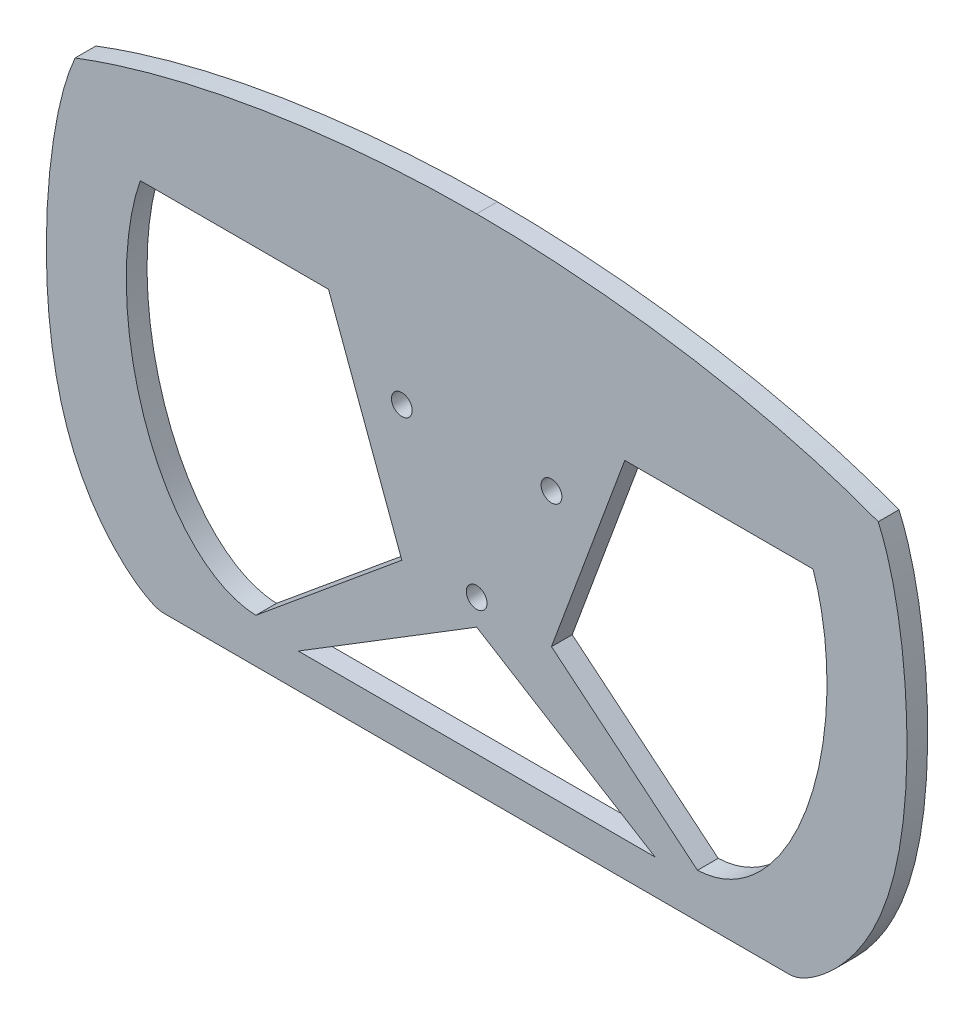
ISO-10303-21;
HEADER;
FILE_DESCRIPTION(('STEP AP214'),'2;1');
FILE_NAME('part.step','',(''),(''),'','','');
FILE_SCHEMA(('AUTOMOTIVE_DESIGN { 1 0 10303 214 1 1 1 1 }'));
ENDSEC;
DATA;
#1=APPLICATION_CONTEXT('core data for automotive mechanical design processes');
#2=APPLICATION_PROTOCOL_DEFINITION('international standard','automotive_design',2000,#1);
#3=PRODUCT_CONTEXT('',#1,'mechanical');
#4=PRODUCT('Part','Part','',(#3));
#5=PRODUCT_RELATED_PRODUCT_CATEGORY('part','',(#4));
#6=PRODUCT_DEFINITION_FORMATION('','',#4);
#7=PRODUCT_DEFINITION_CONTEXT('part definition',#1,'design');
#8=PRODUCT_DEFINITION('design','',#6,#7);
#9=PRODUCT_DEFINITION_SHAPE('','',#8);
#10=(LENGTH_UNIT() NAMED_UNIT(*) SI_UNIT(.MILLI.,.METRE.));
#11=(NAMED_UNIT(*) PLANE_ANGLE_UNIT() SI_UNIT($,.RADIAN.));
#12=(NAMED_UNIT(*) SI_UNIT($,.STERADIAN.) SOLID_ANGLE_UNIT());
#13=UNCERTAINTY_MEASURE_WITH_UNIT(LENGTH_MEASURE(1.E-05),#10,'distance_accuracy_value','');
#14=(GEOMETRIC_REPRESENTATION_CONTEXT(3) GLOBAL_UNCERTAINTY_ASSIGNED_CONTEXT((#13)) GLOBAL_UNIT_ASSIGNED_CONTEXT((#10,
#11,#12)) REPRESENTATION_CONTEXT('',''));
#15=CARTESIAN_POINT('',(0.,0.,0.));
#16=DIRECTION('',(0.,0.,1.));
#17=DIRECTION('',(1.,0.,0.));
#18=AXIS2_PLACEMENT_3D('',#15,#16,#17);
#19=CARTESIAN_POINT('',(-58.9785082805866,66.5630236830182,6.));
#20=DIRECTION('',(0.,0.,-1.));
#21=DIRECTION('',(-1.,0.,0.));
#22=AXIS2_PLACEMENT_3D('',#19,#20,#21);
#23=PLANE('',#22);
#24=DIRECTION('',(-0.85137562168258,0.524556527749489,0.));
#25=VECTOR('',#24,1.);
#26=CARTESIAN_POINT('',(51.5893844332926,-64.2369895868066,6.));
#27=LINE('',#26,#25);
#28=CARTESIAN_POINT('',(51.5893844332926,-64.2369895868066,6.));
#29=VERTEX_POINT('',#28);
#30=CARTESIAN_POINT('',(0.,-32.4513151114445,6.));
#31=VERTEX_POINT('',#30);
#32=EDGE_CURVE('E191',#29,#31,#27,.T.);
#33=ORIENTED_EDGE('',*,*,#32,.F.);
#34=DIRECTION('',(1.,0.,0.));
#35=VECTOR('',#34,1.);
#36=CARTESIAN_POINT('',(-51.5893844332926,-64.2369895868066,6.));
#37=LINE('',#36,#35);
#38=CARTESIAN_POINT('',(-51.5893844332926,-64.2369895868066,6.));
#39=VERTEX_POINT('',#38);
#40=EDGE_CURVE('E197',#39,#29,#37,.T.);
#41=ORIENTED_EDGE('',*,*,#40,.F.);
#42=DIRECTION('',(-0.85137562168258,-0.524556527749489,0.));
#43=VECTOR('',#42,1.);
#44=CARTESIAN_POINT('',(-51.5893844332926,-64.2369895868066,6.));
#45=LINE('',#44,#43);
#46=EDGE_CURVE('E193',#31,#39,#45,.T.);
#47=ORIENTED_EDGE('',*,*,#46,.F.);
#48=EDGE_LOOP('',(#33,#41,#47));
#49=FACE_BOUND('',#48,.T.);
#50=CARTESIAN_POINT('',(0.,-25.,6.));
#51=DIRECTION('',(0.,0.,1.));
#52=DIRECTION('',(1.,0.,0.));
#53=AXIS2_PLACEMENT_3D('',#50,#51,#52);
#54=CIRCLE('',#53,3.);
#55=CARTESIAN_POINT('',(3.,-25.,6.));
#56=VERTEX_POINT('',#55);
#57=EDGE_CURVE('E528',#56,#56,#54,.T.);
#58=ORIENTED_EDGE('',*,*,#57,.F.);
#59=EDGE_LOOP('',(#58));
#60=FACE_BOUND('',#59,.T.);
#61=CARTESIAN_POINT('',(21.650635094611,12.5,6.));
#62=DIRECTION('',(0.,0.,1.));
#63=DIRECTION('',(1.,0.,0.));
#64=AXIS2_PLACEMENT_3D('',#61,#62,#63);
#65=CIRCLE('',#64,3.00000000000001);
#66=CARTESIAN_POINT('',(24.650635094611,12.5,6.));
#67=VERTEX_POINT('',#66);
#68=EDGE_CURVE('E532',#67,#67,#65,.T.);
#69=ORIENTED_EDGE('',*,*,#68,.F.);
#70=EDGE_LOOP('',(#69));
#71=FACE_BOUND('',#70,.T.);
#72=CARTESIAN_POINT('',(-21.650635094611,12.5,6.));
#73=DIRECTION('',(0.,0.,1.));
#74=DIRECTION('',(1.,0.,0.));
#75=AXIS2_PLACEMENT_3D('',#72,#73,#74);
#76=CIRCLE('',#75,3.00000000000001);
#77=CARTESIAN_POINT('',(-18.650635094611,12.5,6.));
#78=VERTEX_POINT('',#77);
#79=EDGE_CURVE('E281',#78,#78,#76,.T.);
#80=ORIENTED_EDGE('',*,*,#79,.F.);
#81=EDGE_LOOP('',(#80));
#82=FACE_BOUND('',#81,.T.);
#83=CARTESIAN_POINT('',(0.,71.1085408069992,6.));
#84=CARTESIAN_POINT('',(-37.0664149320864,71.1085408069992,6.));
#85=CARTESIAN_POINT('',(-81.4792293024218,65.3354816362387,6.));
#86=CARTESIAN_POINT('',(-116.191133541168,52.063581327433,6.));
#87=B_SPLINE_CURVE_WITH_KNOTS('',3,(#83,#84,#85,#86),.UNSPECIFIED.,.F.,.F.,(4,4),(0.,1.),.UNSPECIFIED.);
#88=CARTESIAN_POINT('',(0.,71.1085408069992,6.));
#89=VERTEX_POINT('',#88);
#90=CARTESIAN_POINT('',(-116.191133541168,52.063581327433,6.));
#91=VERTEX_POINT('',#90);
#92=EDGE_CURVE('E304',#89,#91,#87,.T.);
#93=ORIENTED_EDGE('',*,*,#92,.T.);
#94=CARTESIAN_POINT('',(-116.191133541168,52.063581327433,6.));
#95=CARTESIAN_POINT('',(-129.535590873622,22.1396467031414,6.));
#96=CARTESIAN_POINT('',(-126.165778415932,-37.8430150437493,6.));
#97=CARTESIAN_POINT('',(-123.105866617516,-50.1204502558757,6.));
#98=CARTESIAN_POINT('',(-99.8338160125654,-74.2369895868065,6.));
#99=CARTESIAN_POINT('',(-90.5805588627204,-74.2369895868065,6.));
#100=B_SPLINE_CURVE_WITH_KNOTS('',5,(#94,#95,#96,#97,#98,#99),.UNSPECIFIED.,.F.,.F.,(6,6),(0.,
1.),.UNSPECIFIED.);
#101=CARTESIAN_POINT('',(-90.5805588627204,-74.2369895868065,6.));
#102=VERTEX_POINT('',#101);
#103=EDGE_CURVE('E339',#91,#102,#100,.T.);
#104=ORIENTED_EDGE('',*,*,#103,.T.);
#105=DIRECTION('',(1.,0.,0.));
#106=VECTOR('',#105,1.);
#107=CARTESIAN_POINT('',(-90.5805588627204,-74.2369895868065,6.));
#108=LINE('',#107,#106);
#109=CARTESIAN_POINT('',(90.5805588627204,-74.2369895868065,6.));
#110=VERTEX_POINT('',#109);
#111=EDGE_CURVE('E322',#102,#110,#108,.T.);
#112=ORIENTED_EDGE('',*,*,#111,.T.);
#113=CARTESIAN_POINT('',(90.5805588627204,-74.2369895868065,6.));
#114=CARTESIAN_POINT('',(99.8338160125654,-74.2369895868065,6.));
#115=CARTESIAN_POINT('',(123.105866617516,-50.1204502558757,6.));
#116=CARTESIAN_POINT('',(126.165778415932,-37.8430150437493,6.));
#117=CARTESIAN_POINT('',(129.535590873622,22.1396467031414,6.));
#118=CARTESIAN_POINT('',(116.191133541168,52.063581327433,6.));
#119=B_SPLINE_CURVE_WITH_KNOTS('',5,(#113,#114,#115,#116,#117,#118),.UNSPECIFIED.,.F.,.F.,(6,6),
(0.,1.),.UNSPECIFIED.);
#120=CARTESIAN_POINT('',(116.191133541168,52.063581327433,6.));
#121=VERTEX_POINT('',#120);
#122=EDGE_CURVE('E267',#110,#121,#119,.T.);
#123=ORIENTED_EDGE('',*,*,#122,.T.);
#124=CARTESIAN_POINT('',(116.191133541168,52.063581327433,6.));
#125=CARTESIAN_POINT('',(81.4792293024218,65.3354816362387,6.));
#126=CARTESIAN_POINT('',(37.0664149320864,71.1085408069992,6.));
#127=CARTESIAN_POINT('',(0.,71.1085408069992,6.));
#128=B_SPLINE_CURVE_WITH_KNOTS('',3,(#124,#125,#126,#127),.UNSPECIFIED.,.F.,.F.,(4,4),(0.,1.),.UNSPECIFIED.);
#129=EDGE_CURVE('E261',#121,#89,#128,.T.);
#130=ORIENTED_EDGE('',*,*,#129,.T.);
#131=EDGE_LOOP('',(#93,#104,#112,#123,#130));
#132=FACE_BOUND('',#131,.T.);
#133=CARTESIAN_POINT('',(63.8916441978117,-61.4317022475827,6.));
#134=CARTESIAN_POINT('',(88.8282563847214,-60.4881547594294,6.));
#135=CARTESIAN_POINT('',(106.351281164712,-21.9375002434502,6.));
#136=CARTESIAN_POINT('',(103.519165732587,13.1346791544171,6.));
#137=CARTESIAN_POINT('',(97.3201837781014,30.7663665948291,6.));
#138=B_SPLINE_CURVE_WITH_KNOTS('',4,(#133,#134,#135,#136,#137),.UNSPECIFIED.,.F.,.F.,(5,5),(0.,
1.),.UNSPECIFIED.);
#139=CARTESIAN_POINT('',(63.8916441978117,-61.4317022475827,6.));
#140=VERTEX_POINT('',#139);
#141=CARTESIAN_POINT('',(97.3201837781014,30.7663665948291,6.));
#142=VERTEX_POINT('',#141);
#143=EDGE_CURVE('E215',#140,#142,#138,.T.);
#144=ORIENTED_EDGE('',*,*,#143,.F.);
#145=DIRECTION('',(0.770813798016382,-0.637060506378758,0.));
#146=VECTOR('',#145,1.);
#147=CARTESIAN_POINT('',(21.650635094611,-26.5204451859092,6.));
#148=LINE('',#147,#146);
#149=CARTESIAN_POINT('',(21.650635094611,-26.5204451859092,6.));
#150=VERTEX_POINT('',#149);
#151=EDGE_CURVE('E557',#150,#140,#148,.T.);
#152=ORIENTED_EDGE('',*,*,#151,.F.);
#153=DIRECTION('',(-0.347257374644615,-0.937769862895439,0.));
#154=VECTOR('',#153,1.);
#155=CARTESIAN_POINT('',(42.864014461823,30.7663665948291,6.));
#156=LINE('',#155,#154);
#157=CARTESIAN_POINT('',(42.864014461823,30.7663665948291,6.));
#158=VERTEX_POINT('',#157);
#159=EDGE_CURVE('E573',#158,#150,#156,.T.);
#160=ORIENTED_EDGE('',*,*,#159,.F.);
#161=DIRECTION('',(-1.,0.,0.));
#162=VECTOR('',#161,1.);
#163=CARTESIAN_POINT('',(97.3201837781014,30.7663665948291,6.));
#164=LINE('',#163,#162);
#165=EDGE_CURVE('E220',#142,#158,#164,.T.);
#166=ORIENTED_EDGE('',*,*,#165,.F.);
#167=EDGE_LOOP('',(#144,#152,#160,#166));
#168=FACE_BOUND('',#167,.T.);
#169=CARTESIAN_POINT('',(-97.3201837781014,30.7663665948291,6.));
#170=CARTESIAN_POINT('',(-103.519165732587,13.1346791544171,6.));
#171=CARTESIAN_POINT('',(-106.351281164712,-21.9375002434502,6.));
#172=CARTESIAN_POINT('',(-88.8282563847214,-60.4881547594294,6.));
#173=CARTESIAN_POINT('',(-63.8916441978117,-61.4317022475827,6.));
#174=B_SPLINE_CURVE_WITH_KNOTS('',4,(#169,#170,#171,#172,#173),.UNSPECIFIED.,.F.,.F.,(5,5),(0.,
1.),.UNSPECIFIED.);
#175=CARTESIAN_POINT('',(-97.3201837781014,30.7663665948291,6.));
#176=VERTEX_POINT('',#175);
#177=CARTESIAN_POINT('',(-63.8916441978117,-61.4317022475827,6.));
#178=VERTEX_POINT('',#177);
#179=EDGE_CURVE('E147',#176,#178,#174,.T.);
#180=ORIENTED_EDGE('',*,*,#179,.F.);
#181=DIRECTION('',(-1.,0.,0.));
#182=VECTOR('',#181,1.);
#183=CARTESIAN_POINT('',(-97.3201837781014,30.7663665948291,6.));
#184=LINE('',#183,#182);
#185=CARTESIAN_POINT('',(-42.864014461823,30.7663665948291,6.));
#186=VERTEX_POINT('',#185);
#187=EDGE_CURVE('E169',#186,#176,#184,.T.);
#188=ORIENTED_EDGE('',*,*,#187,.F.);
#189=DIRECTION('',(-0.347257374644615,0.937769862895439,0.));
#190=VECTOR('',#189,1.);
#191=CARTESIAN_POINT('',(-42.864014461823,30.7663665948291,6.));
#192=LINE('',#191,#190);
#193=CARTESIAN_POINT('',(-21.650635094611,-26.5204451859092,6.));
#194=VERTEX_POINT('',#193);
#195=EDGE_CURVE('E167',#194,#186,#192,.T.);
#196=ORIENTED_EDGE('',*,*,#195,.F.);
#197=DIRECTION('',(0.770813798016382,0.637060506378758,0.));
#198=VECTOR('',#197,1.);
#199=CARTESIAN_POINT('',(-21.650635094611,-26.5204451859092,6.));
#200=LINE('',#199,#198);
#201=EDGE_CURVE('E155',#178,#194,#200,.T.);
#202=ORIENTED_EDGE('',*,*,#201,.F.);
#203=EDGE_LOOP('',(#180,#188,#196,#202));
#204=FACE_BOUND('',#203,.T.);
#205=ADVANCED_FACE('F33',(#49,#60,#71,#82,#132,#168,#204),#23,.F.);
#206=CARTESIAN_POINT('',(-58.9785082805866,66.5630236830182,0.));
#207=DIRECTION('',(0.,0.,-1.));
#208=DIRECTION('',(-1.,0.,0.));
#209=AXIS2_PLACEMENT_3D('',#206,#207,#208);
#210=PLANE('',#209);
#211=CARTESIAN_POINT('',(21.650635094611,12.5,0.));
#212=DIRECTION('',(0.,0.,1.));
#213=DIRECTION('',(1.,0.,0.));
#214=AXIS2_PLACEMENT_3D('',#211,#212,#213);
#215=CIRCLE('',#214,3.00000000000001);
#216=CARTESIAN_POINT('',(24.650635094611,12.5,0.));
#217=VERTEX_POINT('',#216);
#218=EDGE_CURVE('E539',#217,#217,#215,.T.);
#219=ORIENTED_EDGE('',*,*,#218,.T.);
#220=EDGE_LOOP('',(#219));
#221=FACE_BOUND('',#220,.T.);
#222=CARTESIAN_POINT('',(0.,71.1085408069992,0.));
#223=CARTESIAN_POINT('',(-37.0664149320864,71.1085408069992,0.));
#224=CARTESIAN_POINT('',(-81.4792293024218,65.3354816362387,0.));
#225=CARTESIAN_POINT('',(-116.191133541168,52.063581327433,0.));
#226=B_SPLINE_CURVE_WITH_KNOTS('',3,(#222,#223,#224,#225),.UNSPECIFIED.,.F.,.F.,(4,4),(0.,1.),.UNSPECIFIED.);
#227=CARTESIAN_POINT('',(0.,71.1085408069992,0.));
#228=VERTEX_POINT('',#227);
#229=CARTESIAN_POINT('',(-116.191133541168,52.063581327433,0.));
#230=VERTEX_POINT('',#229);
#231=EDGE_CURVE('E272',#228,#230,#226,.T.);
#232=ORIENTED_EDGE('',*,*,#231,.F.);
#233=CARTESIAN_POINT('',(116.191133541168,52.063581327433,0.));
#234=CARTESIAN_POINT('',(81.4792293024218,65.3354816362387,0.));
#235=CARTESIAN_POINT('',(37.0664149320864,71.1085408069992,0.));
#236=CARTESIAN_POINT('',(0.,71.1085408069992,0.));
#237=B_SPLINE_CURVE_WITH_KNOTS('',3,(#233,#234,#235,#236),.UNSPECIFIED.,.F.,.F.,(4,4),(0.,1.),.UNSPECIFIED.);
#238=CARTESIAN_POINT('',(116.191133541168,52.063581327433,0.));
#239=VERTEX_POINT('',#238);
#240=EDGE_CURVE('E297',#239,#228,#237,.T.);
#241=ORIENTED_EDGE('',*,*,#240,.F.);
#242=CARTESIAN_POINT('',(90.5805588627204,-74.2369895868065,0.));
#243=CARTESIAN_POINT('',(99.8338160125654,-74.2369895868065,0.));
#244=CARTESIAN_POINT('',(123.105866617516,-50.1204502558757,0.));
#245=CARTESIAN_POINT('',(126.165778415932,-37.8430150437493,0.));
#246=CARTESIAN_POINT('',(129.535590873622,22.1396467031414,0.));
#247=CARTESIAN_POINT('',(116.191133541168,52.063581327433,0.));
#248=B_SPLINE_CURVE_WITH_KNOTS('',5,(#242,#243,#244,#245,#246,#247),.UNSPECIFIED.,.F.,.F.,(6,6),
(0.,1.),.UNSPECIFIED.);
#249=CARTESIAN_POINT('',(90.5805588627204,-74.2369895868065,0.));
#250=VERTEX_POINT('',#249);
#251=EDGE_CURVE('E293',#250,#239,#248,.T.);
#252=ORIENTED_EDGE('',*,*,#251,.F.);
#253=DIRECTION('',(1.,0.,0.));
#254=VECTOR('',#253,1.);
#255=CARTESIAN_POINT('',(-90.5805588627204,-74.2369895868065,0.));
#256=LINE('',#255,#254);
#257=CARTESIAN_POINT('',(-90.5805588627204,-74.2369895868065,0.));
#258=VERTEX_POINT('',#257);
#259=EDGE_CURVE('E288',#258,#250,#256,.T.);
#260=ORIENTED_EDGE('',*,*,#259,.F.);
#261=CARTESIAN_POINT('',(-116.191133541168,52.063581327433,0.));
#262=CARTESIAN_POINT('',(-129.535590873622,22.1396467031414,0.));
#263=CARTESIAN_POINT('',(-126.165778415932,-37.8430150437493,0.));
#264=CARTESIAN_POINT('',(-123.105866617516,-50.1204502558757,0.));
#265=CARTESIAN_POINT('',(-99.8338160125654,-74.2369895868065,0.));
#266=CARTESIAN_POINT('',(-90.5805588627204,-74.2369895868065,0.));
#267=B_SPLINE_CURVE_WITH_KNOTS('',5,(#261,#262,#263,#264,#265,#266),.UNSPECIFIED.,.F.,.F.,(6,6),
(0.,1.),.UNSPECIFIED.);
#268=EDGE_CURVE('E280',#230,#258,#267,.T.);
#269=ORIENTED_EDGE('',*,*,#268,.F.);
#270=EDGE_LOOP('',(#232,#241,#252,#260,#269));
#271=FACE_BOUND('',#270,.T.);
#272=CARTESIAN_POINT('',(-21.650635094611,12.5,0.));
#273=DIRECTION('',(0.,0.,1.));
#274=DIRECTION('',(1.,0.,0.));
#275=AXIS2_PLACEMENT_3D('',#272,#273,#274);
#276=CIRCLE('',#275,3.00000000000001);
#277=CARTESIAN_POINT('',(-18.650635094611,12.5,0.));
#278=VERTEX_POINT('',#277);
#279=EDGE_CURVE('E535',#278,#278,#276,.T.);
#280=ORIENTED_EDGE('',*,*,#279,.T.);
#281=EDGE_LOOP('',(#280));
#282=FACE_BOUND('',#281,.T.);
#283=CARTESIAN_POINT('',(0.,-25.,0.));
#284=DIRECTION('',(0.,0.,1.));
#285=DIRECTION('',(1.,0.,0.));
#286=AXIS2_PLACEMENT_3D('',#283,#284,#285);
#287=CIRCLE('',#286,3.);
#288=CARTESIAN_POINT('',(3.,-25.,0.));
#289=VERTEX_POINT('',#288);
#290=EDGE_CURVE('E543',#289,#289,#287,.T.);
#291=ORIENTED_EDGE('',*,*,#290,.T.);
#292=EDGE_LOOP('',(#291));
#293=FACE_BOUND('',#292,.T.);
#294=DIRECTION('',(0.770813798016382,-0.637060506378758,0.));
#295=VECTOR('',#294,1.);
#296=CARTESIAN_POINT('',(21.650635094611,-26.5204451859092,0.));
#297=LINE('',#296,#295);
#298=CARTESIAN_POINT('',(21.650635094611,-26.5204451859092,0.));
#299=VERTEX_POINT('',#298);
#300=CARTESIAN_POINT('',(63.8916441978117,-61.4317022475827,0.));
#301=VERTEX_POINT('',#300);
#302=EDGE_CURVE('E221',#299,#301,#297,.T.);
#303=ORIENTED_EDGE('',*,*,#302,.T.);
#304=CARTESIAN_POINT('',(63.8916441978117,-61.4317022475827,0.));
#305=CARTESIAN_POINT('',(88.8282563847214,-60.4881547594294,0.));
#306=CARTESIAN_POINT('',(106.351281164712,-21.9375002434502,0.));
#307=CARTESIAN_POINT('',(103.519165732587,13.1346791544171,0.));
#308=CARTESIAN_POINT('',(97.3201837781014,30.7663665948291,0.));
#309=B_SPLINE_CURVE_WITH_KNOTS('',4,(#304,#305,#306,#307,#308),.UNSPECIFIED.,.F.,.F.,(5,5),(0.,
1.),.UNSPECIFIED.);
#310=CARTESIAN_POINT('',(97.3201837781014,30.7663665948291,0.));
#311=VERTEX_POINT('',#310);
#312=EDGE_CURVE('E214',#301,#311,#309,.T.);
#313=ORIENTED_EDGE('',*,*,#312,.T.);
#314=DIRECTION('',(-1.,0.,0.));
#315=VECTOR('',#314,1.);
#316=CARTESIAN_POINT('',(97.3201837781014,30.7663665948291,0.));
#317=LINE('',#316,#315);
#318=CARTESIAN_POINT('',(42.864014461823,30.7663665948291,0.));
#319=VERTEX_POINT('',#318);
#320=EDGE_CURVE('E563',#311,#319,#317,.T.);
#321=ORIENTED_EDGE('',*,*,#320,.T.);
#322=DIRECTION('',(-0.347257374644615,-0.937769862895439,0.));
#323=VECTOR('',#322,1.);
#324=CARTESIAN_POINT('',(42.864014461823,30.7663665948291,0.));
#325=LINE('',#324,#323);
#326=EDGE_CURVE('E560',#319,#299,#325,.T.);
#327=ORIENTED_EDGE('',*,*,#326,.T.);
#328=EDGE_LOOP('',(#303,#313,#321,#327));
#329=FACE_BOUND('',#328,.T.);
#330=DIRECTION('',(1.,0.,0.));
#331=VECTOR('',#330,1.);
#332=CARTESIAN_POINT('',(-51.5893844332926,-64.2369895868066,0.));
#333=LINE('',#332,#331);
#334=CARTESIAN_POINT('',(-51.5893844332926,-64.2369895868066,0.));
#335=VERTEX_POINT('',#334);
#336=CARTESIAN_POINT('',(51.5893844332926,-64.2369895868066,0.));
#337=VERTEX_POINT('',#336);
#338=EDGE_CURVE('E194',#335,#337,#333,.T.);
#339=ORIENTED_EDGE('',*,*,#338,.T.);
#340=DIRECTION('',(-0.85137562168258,0.524556527749489,0.));
#341=VECTOR('',#340,1.);
#342=CARTESIAN_POINT('',(51.5893844332926,-64.2369895868066,0.));
#343=LINE('',#342,#341);
#344=CARTESIAN_POINT('',(0.,-32.4513151114445,0.));
#345=VERTEX_POINT('',#344);
#346=EDGE_CURVE('E163',#337,#345,#343,.T.);
#347=ORIENTED_EDGE('',*,*,#346,.T.);
#348=DIRECTION('',(-0.85137562168258,-0.524556527749489,0.));
#349=VECTOR('',#348,1.);
#350=CARTESIAN_POINT('',(-51.5893844332926,-64.2369895868066,0.));
#351=LINE('',#350,#349);
#352=EDGE_CURVE('E202',#345,#335,#351,.T.);
#353=ORIENTED_EDGE('',*,*,#352,.T.);
#354=EDGE_LOOP('',(#339,#347,#353));
#355=FACE_BOUND('',#354,.T.);
#356=DIRECTION('',(-1.,0.,0.));
#357=VECTOR('',#356,1.);
#358=CARTESIAN_POINT('',(-97.3201837781014,30.7663665948291,0.));
#359=LINE('',#358,#357);
#360=CARTESIAN_POINT('',(-42.864014461823,30.7663665948291,0.));
#361=VERTEX_POINT('',#360);
#362=CARTESIAN_POINT('',(-97.3201837781014,30.7663665948291,0.));
#363=VERTEX_POINT('',#362);
#364=EDGE_CURVE('E156',#361,#363,#359,.T.);
#365=ORIENTED_EDGE('',*,*,#364,.T.);
#366=CARTESIAN_POINT('',(-97.3201837781014,30.7663665948291,0.));
#367=CARTESIAN_POINT('',(-103.519165732587,13.1346791544171,0.));
#368=CARTESIAN_POINT('',(-106.351281164712,-21.9375002434502,0.));
#369=CARTESIAN_POINT('',(-88.8282563847214,-60.4881547594294,0.));
#370=CARTESIAN_POINT('',(-63.8916441978117,-61.4317022475827,0.));
#371=B_SPLINE_CURVE_WITH_KNOTS('',4,(#366,#367,#368,#369,#370),.UNSPECIFIED.,.F.,.F.,(5,5),(0.,
1.),.UNSPECIFIED.);
#372=CARTESIAN_POINT('',(-63.8916441978117,-61.4317022475827,0.));
#373=VERTEX_POINT('',#372);
#374=EDGE_CURVE('E57',#363,#373,#371,.T.);
#375=ORIENTED_EDGE('',*,*,#374,.T.);
#376=DIRECTION('',(0.770813798016382,0.637060506378758,0.));
#377=VECTOR('',#376,1.);
#378=CARTESIAN_POINT('',(-21.650635094611,-26.5204451859092,0.));
#379=LINE('',#378,#377);
#380=CARTESIAN_POINT('',(-21.650635094611,-26.5204451859092,0.));
#381=VERTEX_POINT('',#380);
#382=EDGE_CURVE('E162',#373,#381,#379,.T.);
#383=ORIENTED_EDGE('',*,*,#382,.T.);
#384=DIRECTION('',(-0.347257374644615,0.937769862895439,0.));
#385=VECTOR('',#384,1.);
#386=CARTESIAN_POINT('',(-42.864014461823,30.7663665948291,0.));
#387=LINE('',#386,#385);
#388=EDGE_CURVE('E183',#381,#361,#387,.T.);
#389=ORIENTED_EDGE('',*,*,#388,.T.);
#390=EDGE_LOOP('',(#365,#375,#383,#389));
#391=FACE_BOUND('',#390,.T.);
#392=ADVANCED_FACE('F249',(#221,#271,#282,#293,#329,#355,#391),#210,.T.);
#393=DIRECTION('',(0.,0.,-1.));
#394=VECTOR('',#393,1.);
#395=SURFACE_OF_LINEAR_EXTRUSION('',#87,#394);
#396=ORIENTED_EDGE('',*,*,#231,.T.);
#397=DIRECTION('',(0.,0.,-1.));
#398=VECTOR('',#397,1.);
#399=CARTESIAN_POINT('',(-116.191133541168,52.063581327433,6.));
#400=LINE('',#399,#398);
#401=EDGE_CURVE('E11',#91,#230,#400,.T.);
#402=ORIENTED_EDGE('',*,*,#401,.F.);
#403=ORIENTED_EDGE('',*,*,#92,.F.);
#404=DIRECTION('',(0.,0.,-1.));
#405=VECTOR('',#404,1.);
#406=CARTESIAN_POINT('',(0.,71.1085408069992,6.));
#407=LINE('',#406,#405);
#408=EDGE_CURVE('E266',#89,#228,#407,.T.);
#409=ORIENTED_EDGE('',*,*,#408,.T.);
#410=EDGE_LOOP('',(#396,#402,#403,#409));
#411=FACE_BOUND('',#410,.T.);
#412=ADVANCED_FACE('F35',(#411),#395,.F.);
#413=DIRECTION('',(0.,0.,-1.));
#414=VECTOR('',#413,1.);
#415=SURFACE_OF_LINEAR_EXTRUSION('',#100,#414);
#416=ORIENTED_EDGE('',*,*,#268,.T.);
#417=DIRECTION('',(0.,0.,-1.));
#418=VECTOR('',#417,1.);
#419=CARTESIAN_POINT('',(-90.5805588627204,-74.2369895868065,6.));
#420=LINE('',#419,#418);
#421=EDGE_CURVE('E42',#102,#258,#420,.T.);
#422=ORIENTED_EDGE('',*,*,#421,.F.);
#423=ORIENTED_EDGE('',*,*,#103,.F.);
#424=ORIENTED_EDGE('',*,*,#401,.T.);
#425=EDGE_LOOP('',(#416,#422,#423,#424));
#426=FACE_BOUND('',#425,.T.);
#427=ADVANCED_FACE('F351',(#426),#415,.F.);
#428=CARTESIAN_POINT('',(-90.5805588627204,-74.2369895868065,6.));
#429=DIRECTION('',(0.,1.,0.));
#430=DIRECTION('',(0.,0.,1.));
#431=AXIS2_PLACEMENT_3D('',#428,#429,#430);
#432=PLANE('',#431);
#433=ORIENTED_EDGE('',*,*,#259,.T.);
#434=DIRECTION('',(0.,0.,-1.));
#435=VECTOR('',#434,1.);
#436=CARTESIAN_POINT('',(90.5805588627204,-74.2369895868065,6.));
#437=LINE('',#436,#435);
#438=EDGE_CURVE('E313',#110,#250,#437,.T.);
#439=ORIENTED_EDGE('',*,*,#438,.F.);
#440=ORIENTED_EDGE('',*,*,#111,.F.);
#441=ORIENTED_EDGE('',*,*,#421,.T.);
#442=EDGE_LOOP('',(#433,#439,#440,#441));
#443=FACE_BOUND('',#442,.T.);
#444=ADVANCED_FACE('F320',(#443),#432,.F.);
#445=DIRECTION('',(0.,0.,-1.));
#446=VECTOR('',#445,1.);
#447=SURFACE_OF_LINEAR_EXTRUSION('',#119,#446);
#448=ORIENTED_EDGE('',*,*,#251,.T.);
#449=DIRECTION('',(0.,0.,-1.));
#450=VECTOR('',#449,1.);
#451=CARTESIAN_POINT('',(116.191133541168,52.063581327433,6.));
#452=LINE('',#451,#450);
#453=EDGE_CURVE('E310',#121,#239,#452,.T.);
#454=ORIENTED_EDGE('',*,*,#453,.F.);
#455=ORIENTED_EDGE('',*,*,#122,.F.);
#456=ORIENTED_EDGE('',*,*,#438,.T.);
#457=EDGE_LOOP('',(#448,#454,#455,#456));
#458=FACE_BOUND('',#457,.T.);
#459=ADVANCED_FACE('F257',(#458),#447,.F.);
#460=DIRECTION('',(0.,0.,-1.));
#461=VECTOR('',#460,1.);
#462=SURFACE_OF_LINEAR_EXTRUSION('',#128,#461);
#463=ORIENTED_EDGE('',*,*,#240,.T.);
#464=ORIENTED_EDGE('',*,*,#408,.F.);
#465=ORIENTED_EDGE('',*,*,#129,.F.);
#466=ORIENTED_EDGE('',*,*,#453,.T.);
#467=EDGE_LOOP('',(#463,#464,#465,#466));
#468=FACE_BOUND('',#467,.T.);
#469=ADVANCED_FACE('F245',(#468),#462,.F.);
#470=CARTESIAN_POINT('',(-21.650635094611,12.5,6.));
#471=DIRECTION('',(0.,0.,-1.));
#472=DIRECTION('',(-1.,0.,0.));
#473=AXIS2_PLACEMENT_3D('',#470,#471,#472);
#474=CYLINDRICAL_SURFACE('',#473,3.00000000000001);
#475=ORIENTED_EDGE('',*,*,#79,.T.);
#476=EDGE_LOOP('',(#475));
#477=FACE_BOUND('',#476,.T.);
#478=ORIENTED_EDGE('',*,*,#279,.F.);
#479=EDGE_LOOP('',(#478));
#480=FACE_BOUND('',#479,.T.);
#481=ADVANCED_FACE('F241',(#477,#480),#474,.F.);
#482=CARTESIAN_POINT('',(21.650635094611,12.5,6.));
#483=DIRECTION('',(0.,0.,-1.));
#484=DIRECTION('',(-1.,0.,0.));
#485=AXIS2_PLACEMENT_3D('',#482,#483,#484);
#486=CYLINDRICAL_SURFACE('',#485,3.00000000000001);
#487=ORIENTED_EDGE('',*,*,#68,.T.);
#488=EDGE_LOOP('',(#487));
#489=FACE_BOUND('',#488,.T.);
#490=ORIENTED_EDGE('',*,*,#218,.F.);
#491=EDGE_LOOP('',(#490));
#492=FACE_BOUND('',#491,.T.);
#493=ADVANCED_FACE('F237',(#489,#492),#486,.F.);
#494=CARTESIAN_POINT('',(0.,-25.,6.));
#495=DIRECTION('',(0.,0.,-1.));
#496=DIRECTION('',(-1.,0.,0.));
#497=AXIS2_PLACEMENT_3D('',#494,#495,#496);
#498=CYLINDRICAL_SURFACE('',#497,3.);
#499=ORIENTED_EDGE('',*,*,#57,.T.);
#500=EDGE_LOOP('',(#499));
#501=FACE_BOUND('',#500,.T.);
#502=ORIENTED_EDGE('',*,*,#290,.F.);
#503=EDGE_LOOP('',(#502));
#504=FACE_BOUND('',#503,.T.);
#505=ADVANCED_FACE('F232',(#501,#504),#498,.F.);
#506=DIRECTION('',(0.,0.,-1.));
#507=VECTOR('',#506,1.);
#508=SURFACE_OF_LINEAR_EXTRUSION('',#138,#507);
#509=ORIENTED_EDGE('',*,*,#312,.F.);
#510=DIRECTION('',(0.,0.,-1.));
#511=VECTOR('',#510,1.);
#512=CARTESIAN_POINT('',(63.8916441978117,-61.4317022475827,6.));
#513=LINE('',#512,#511);
#514=EDGE_CURVE('E554',#140,#301,#513,.T.);
#515=ORIENTED_EDGE('',*,*,#514,.F.);
#516=ORIENTED_EDGE('',*,*,#143,.T.);
#517=DIRECTION('',(0.,0.,-1.));
#518=VECTOR('',#517,1.);
#519=CARTESIAN_POINT('',(97.3201837781014,30.7663665948291,6.));
#520=LINE('',#519,#518);
#521=EDGE_CURVE('E546',#142,#311,#520,.T.);
#522=ORIENTED_EDGE('',*,*,#521,.T.);
#523=EDGE_LOOP('',(#509,#515,#516,#522));
#524=FACE_BOUND('',#523,.T.);
#525=ADVANCED_FACE('F227',(#524),#508,.T.);
#526=CARTESIAN_POINT('',(97.3201837781014,30.7663665948291,6.));
#527=DIRECTION('',(0.,-1.,0.));
#528=DIRECTION('',(0.,0.,-1.));
#529=AXIS2_PLACEMENT_3D('',#526,#527,#528);
#530=PLANE('',#529);
#531=ORIENTED_EDGE('',*,*,#320,.F.);
#532=ORIENTED_EDGE('',*,*,#521,.F.);
#533=ORIENTED_EDGE('',*,*,#165,.T.);
#534=DIRECTION('',(0.,0.,-1.));
#535=VECTOR('',#534,1.);
#536=CARTESIAN_POINT('',(42.864014461823,30.7663665948291,6.));
#537=LINE('',#536,#535);
#538=EDGE_CURVE('E550',#158,#319,#537,.T.);
#539=ORIENTED_EDGE('',*,*,#538,.T.);
#540=EDGE_LOOP('',(#531,#532,#533,#539));
#541=FACE_BOUND('',#540,.T.);
#542=ADVANCED_FACE('F231',(#541),#530,.T.);
#543=CARTESIAN_POINT('',(42.864014461823,30.7663665948291,6.));
#544=DIRECTION('',(0.937769862895439,-0.347257374644615,0.));
#545=DIRECTION('',(0.347257374644615,0.937769862895439,0.));
#546=AXIS2_PLACEMENT_3D('',#543,#544,#545);
#547=PLANE('',#546);
#548=ORIENTED_EDGE('',*,*,#326,.F.);
#549=ORIENTED_EDGE('',*,*,#538,.F.);
#550=ORIENTED_EDGE('',*,*,#159,.T.);
#551=DIRECTION('',(0.,0.,-1.));
#552=VECTOR('',#551,1.);
#553=CARTESIAN_POINT('',(21.650635094611,-26.5204451859092,6.));
#554=LINE('',#553,#552);
#555=EDGE_CURVE('E552',#150,#299,#554,.T.);
#556=ORIENTED_EDGE('',*,*,#555,.T.);
#557=EDGE_LOOP('',(#548,#549,#550,#556));
#558=FACE_BOUND('',#557,.T.);
#559=ADVANCED_FACE('F385',(#558),#547,.T.);
#560=CARTESIAN_POINT('',(21.650635094611,-26.5204451859092,6.));
#561=DIRECTION('',(0.637060506378758,0.770813798016383,0.));
#562=DIRECTION('',(-0.770813798016383,0.637060506378758,0.));
#563=AXIS2_PLACEMENT_3D('',#560,#561,#562);
#564=PLANE('',#563);
#565=ORIENTED_EDGE('',*,*,#302,.F.);
#566=ORIENTED_EDGE('',*,*,#555,.F.);
#567=ORIENTED_EDGE('',*,*,#151,.T.);
#568=ORIENTED_EDGE('',*,*,#514,.T.);
#569=EDGE_LOOP('',(#565,#566,#567,#568));
#570=FACE_BOUND('',#569,.T.);
#571=ADVANCED_FACE('F392',(#570),#564,.T.);
#572=CARTESIAN_POINT('',(51.5893844332926,-64.2369895868066,6.));
#573=DIRECTION('',(-0.524556527749489,-0.85137562168258,0.));
#574=DIRECTION('',(0.85137562168258,-0.524556527749489,0.));
#575=AXIS2_PLACEMENT_3D('',#572,#573,#574);
#576=PLANE('',#575);
#577=ORIENTED_EDGE('',*,*,#346,.F.);
#578=DIRECTION('',(0.,0.,-1.));
#579=VECTOR('',#578,1.);
#580=CARTESIAN_POINT('',(51.5893844332926,-64.2369895868066,6.));
#581=LINE('',#580,#579);
#582=EDGE_CURVE('E199',#29,#337,#581,.T.);
#583=ORIENTED_EDGE('',*,*,#582,.F.);
#584=ORIENTED_EDGE('',*,*,#32,.T.);
#585=DIRECTION('',(0.,0.,-1.));
#586=VECTOR('',#585,1.);
#587=CARTESIAN_POINT('',(0.,-32.4513151114445,6.));
#588=LINE('',#587,#586);
#589=EDGE_CURVE('E211',#31,#345,#588,.T.);
#590=ORIENTED_EDGE('',*,*,#589,.T.);
#591=EDGE_LOOP('',(#577,#583,#584,#590));
#592=FACE_BOUND('',#591,.T.);
#593=ADVANCED_FACE('F399',(#592),#576,.T.);
#594=CARTESIAN_POINT('',(-51.5893844332926,-64.2369895868066,6.));
#595=DIRECTION('',(0.524556527749489,-0.85137562168258,0.));
#596=DIRECTION('',(0.85137562168258,0.524556527749489,0.));
#597=AXIS2_PLACEMENT_3D('',#594,#595,#596);
#598=PLANE('',#597);
#599=ORIENTED_EDGE('',*,*,#352,.F.);
#600=ORIENTED_EDGE('',*,*,#589,.F.);
#601=ORIENTED_EDGE('',*,*,#46,.T.);
#602=DIRECTION('',(0.,0.,-1.));
#603=VECTOR('',#602,1.);
#604=CARTESIAN_POINT('',(-51.5893844332926,-64.2369895868066,6.));
#605=LINE('',#604,#603);
#606=EDGE_CURVE('E209',#39,#335,#605,.T.);
#607=ORIENTED_EDGE('',*,*,#606,.T.);
#608=EDGE_LOOP('',(#599,#600,#601,#607));
#609=FACE_BOUND('',#608,.T.);
#610=ADVANCED_FACE('F407',(#609),#598,.T.);
#611=CARTESIAN_POINT('',(-51.5893844332926,-64.2369895868066,6.));
#612=DIRECTION('',(0.,1.,0.));
#613=DIRECTION('',(0.,0.,1.));
#614=AXIS2_PLACEMENT_3D('',#611,#612,#613);
#615=PLANE('',#614);
#616=ORIENTED_EDGE('',*,*,#338,.F.);
#617=ORIENTED_EDGE('',*,*,#606,.F.);
#618=ORIENTED_EDGE('',*,*,#40,.T.);
#619=ORIENTED_EDGE('',*,*,#582,.T.);
#620=EDGE_LOOP('',(#616,#617,#618,#619));
#621=FACE_BOUND('',#620,.T.);
#622=ADVANCED_FACE('F415',(#621),#615,.T.);
#623=DIRECTION('',(0.,0.,-1.));
#624=VECTOR('',#623,1.);
#625=SURFACE_OF_LINEAR_EXTRUSION('',#174,#624);
#626=ORIENTED_EDGE('',*,*,#374,.F.);
#627=DIRECTION('',(0.,0.,-1.));
#628=VECTOR('',#627,1.);
#629=CARTESIAN_POINT('',(-97.3201837781014,30.7663665948291,6.));
#630=LINE('',#629,#628);
#631=EDGE_CURVE('E151',#176,#363,#630,.T.);
#632=ORIENTED_EDGE('',*,*,#631,.F.);
#633=ORIENTED_EDGE('',*,*,#179,.T.);
#634=DIRECTION('',(0.,0.,-1.));
#635=VECTOR('',#634,1.);
#636=CARTESIAN_POINT('',(-63.8916441978117,-61.4317022475827,6.));
#637=LINE('',#636,#635);
#638=EDGE_CURVE('E150',#178,#373,#637,.T.);
#639=ORIENTED_EDGE('',*,*,#638,.T.);
#640=EDGE_LOOP('',(#626,#632,#633,#639));
#641=FACE_BOUND('',#640,.T.);
#642=ADVANCED_FACE('F149',(#641),#625,.T.);
#643=CARTESIAN_POINT('',(-21.650635094611,-26.5204451859092,6.));
#644=DIRECTION('',(-0.637060506378758,0.770813798016383,0.));
#645=DIRECTION('',(-0.770813798016383,-0.637060506378758,0.));
#646=AXIS2_PLACEMENT_3D('',#643,#644,#645);
#647=PLANE('',#646);
#648=ORIENTED_EDGE('',*,*,#382,.F.);
#649=ORIENTED_EDGE('',*,*,#638,.F.);
#650=ORIENTED_EDGE('',*,*,#201,.T.);
#651=DIRECTION('',(0.,0.,-1.));
#652=VECTOR('',#651,1.);
#653=CARTESIAN_POINT('',(-21.650635094611,-26.5204451859092,6.));
#654=LINE('',#653,#652);
#655=EDGE_CURVE('E164',#194,#381,#654,.T.);
#656=ORIENTED_EDGE('',*,*,#655,.T.);
#657=EDGE_LOOP('',(#648,#649,#650,#656));
#658=FACE_BOUND('',#657,.T.);
#659=ADVANCED_FACE('F159',(#658),#647,.T.);
#660=CARTESIAN_POINT('',(-42.864014461823,30.7663665948291,6.));
#661=DIRECTION('',(-0.937769862895439,-0.347257374644615,0.));
#662=DIRECTION('',(0.347257374644615,-0.937769862895439,0.));
#663=AXIS2_PLACEMENT_3D('',#660,#661,#662);
#664=PLANE('',#663);
#665=ORIENTED_EDGE('',*,*,#388,.F.);
#666=ORIENTED_EDGE('',*,*,#655,.F.);
#667=ORIENTED_EDGE('',*,*,#195,.T.);
#668=DIRECTION('',(0.,0.,-1.));
#669=VECTOR('',#668,1.);
#670=CARTESIAN_POINT('',(-42.864014461823,30.7663665948291,6.));
#671=LINE('',#670,#669);
#672=EDGE_CURVE('E49',#186,#361,#671,.T.);
#673=ORIENTED_EDGE('',*,*,#672,.T.);
#674=EDGE_LOOP('',(#665,#666,#667,#673));
#675=FACE_BOUND('',#674,.T.);
#676=ADVANCED_FACE('F436',(#675),#664,.T.);
#677=CARTESIAN_POINT('',(-97.3201837781014,30.7663665948291,6.));
#678=DIRECTION('',(0.,-1.,0.));
#679=DIRECTION('',(0.,0.,-1.));
#680=AXIS2_PLACEMENT_3D('',#677,#678,#679);
#681=PLANE('',#680);
#682=ORIENTED_EDGE('',*,*,#364,.F.);
#683=ORIENTED_EDGE('',*,*,#672,.F.);
#684=ORIENTED_EDGE('',*,*,#187,.T.);
#685=ORIENTED_EDGE('',*,*,#631,.T.);
#686=EDGE_LOOP('',(#682,#683,#684,#685));
#687=FACE_BOUND('',#686,.T.);
#688=ADVANCED_FACE('F443',(#687),#681,.T.);
#689=CLOSED_SHELL('',(#205,#392,#412,#427,#444,#459,#469,#481,#493,#505,#525,#542,#559,#571,
#593,#610,#622,#642,#659,#676,#688));
#690=MANIFOLD_SOLID_BREP('B2',#689);
#691=ADVANCED_BREP_SHAPE_REPRESENTATION('',(#18,#690),#14);
#692=SHAPE_DEFINITION_REPRESENTATION(#9,#691);
ENDSEC;
END-ISO-10303-21;
